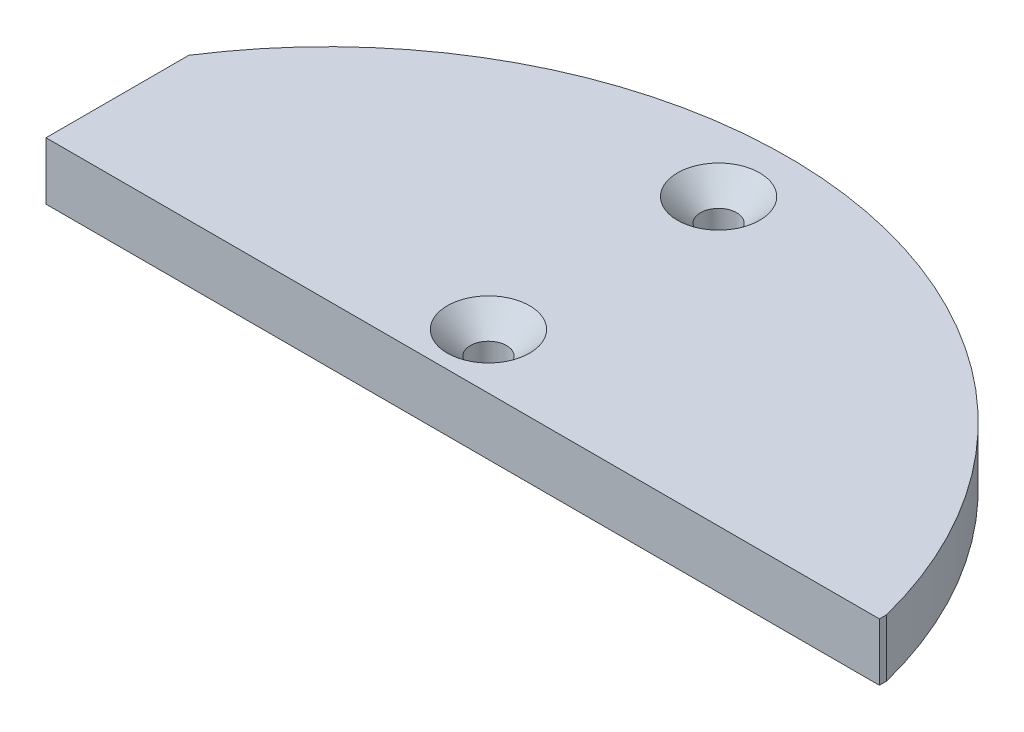
ISO-10303-21;
HEADER;
FILE_DESCRIPTION(('STEP AP214'),'2;1');
FILE_NAME('part.step','',(''),(''),'','','');
FILE_SCHEMA(('AUTOMOTIVE_DESIGN { 1 0 10303 214 1 1 1 1 }'));
ENDSEC;
DATA;
#1=APPLICATION_CONTEXT('core data for automotive mechanical design processes');
#2=APPLICATION_PROTOCOL_DEFINITION('international standard','automotive_design',2000,#1);
#3=PRODUCT_CONTEXT('',#1,'mechanical');
#4=PRODUCT('Part','Part','',(#3));
#5=PRODUCT_RELATED_PRODUCT_CATEGORY('part','',(#4));
#6=PRODUCT_DEFINITION_FORMATION('','',#4);
#7=PRODUCT_DEFINITION_CONTEXT('part definition',#1,'design');
#8=PRODUCT_DEFINITION('design','',#6,#7);
#9=PRODUCT_DEFINITION_SHAPE('','',#8);
#10=(LENGTH_UNIT() NAMED_UNIT(*) SI_UNIT(.MILLI.,.METRE.));
#11=(NAMED_UNIT(*) PLANE_ANGLE_UNIT() SI_UNIT($,.RADIAN.));
#12=(NAMED_UNIT(*) SI_UNIT($,.STERADIAN.) SOLID_ANGLE_UNIT());
#13=UNCERTAINTY_MEASURE_WITH_UNIT(LENGTH_MEASURE(1.E-05),#10,'distance_accuracy_value','');
#14=(GEOMETRIC_REPRESENTATION_CONTEXT(3) GLOBAL_UNCERTAINTY_ASSIGNED_CONTEXT((#13)) GLOBAL_UNIT_ASSIGNED_CONTEXT((#10,
#11,#12)) REPRESENTATION_CONTEXT('',''));
#15=CARTESIAN_POINT('',(0.,0.,0.));
#16=DIRECTION('',(0.,0.,1.));
#17=DIRECTION('',(1.,0.,0.));
#18=AXIS2_PLACEMENT_3D('',#15,#16,#17);
#19=CARTESIAN_POINT('',(0.,6.35,-11.684));
#20=DIRECTION('',(0.,0.,-1.));
#21=DIRECTION('',(-1.,0.,0.));
#22=AXIS2_PLACEMENT_3D('',#19,#20,#21);
#23=PLANE('',#22);
#24=DIRECTION('',(1.,0.,0.));
#25=VECTOR('',#24,1.);
#26=CARTESIAN_POINT('',(0.,0.,-11.684));
#27=LINE('',#26,#25);
#28=CARTESIAN_POINT('',(-42.746,0.,-11.684));
#29=VERTEX_POINT('',#28);
#30=CARTESIAN_POINT('',(49.2434251855589,0.,-11.684));
#31=VERTEX_POINT('',#30);
#32=EDGE_CURVE('E406',#29,#31,#27,.T.);
#33=ORIENTED_EDGE('',*,*,#32,.T.);
#34=DIRECTION('',(0.,-1.,0.));
#35=VECTOR('',#34,1.);
#36=CARTESIAN_POINT('',(49.2434251855589,6.35,-11.684));
#37=LINE('',#36,#35);
#38=CARTESIAN_POINT('',(49.2434251855589,6.35,-11.684));
#39=VERTEX_POINT('',#38);
#40=EDGE_CURVE('E386',#39,#31,#37,.T.);
#41=ORIENTED_EDGE('',*,*,#40,.F.);
#42=DIRECTION('',(1.,0.,0.));
#43=VECTOR('',#42,1.);
#44=CARTESIAN_POINT('',(0.,6.35,-11.684));
#45=LINE('',#44,#43);
#46=CARTESIAN_POINT('',(-42.746,6.35,-11.684));
#47=VERTEX_POINT('',#46);
#48=EDGE_CURVE('E400',#47,#39,#45,.T.);
#49=ORIENTED_EDGE('',*,*,#48,.F.);
#50=DIRECTION('',(0.,-1.,0.));
#51=VECTOR('',#50,1.);
#52=CARTESIAN_POINT('',(-42.746,6.35,-11.684));
#53=LINE('',#52,#51);
#54=EDGE_CURVE('E394',#47,#29,#53,.T.);
#55=ORIENTED_EDGE('',*,*,#54,.T.);
#56=EDGE_LOOP('',(#33,#41,#49,#55));
#57=FACE_BOUND('',#56,.T.);
#58=ADVANCED_FACE('F49',(#57),#23,.F.);
#59=CARTESIAN_POINT('',(49.2434251855589,6.35,0.));
#60=DIRECTION('',(-1.,0.,0.));
#61=DIRECTION('',(0.,0.,1.));
#62=AXIS2_PLACEMENT_3D('',#59,#60,#61);
#63=PLANE('',#62);
#64=DIRECTION('',(0.,0.,-1.));
#65=VECTOR('',#64,1.);
#66=CARTESIAN_POINT('',(49.2434251855589,0.,0.));
#67=LINE('',#66,#65);
#68=CARTESIAN_POINT('',(49.2434251855589,0.,-12.4789853751923));
#69=VERTEX_POINT('',#68);
#70=EDGE_CURVE('E404',#31,#69,#67,.T.);
#71=ORIENTED_EDGE('',*,*,#70,.T.);
#72=DIRECTION('',(0.,-1.,0.));
#73=VECTOR('',#72,1.);
#74=CARTESIAN_POINT('',(49.2434251855589,6.35,-12.4789853751923));
#75=LINE('',#74,#73);
#76=CARTESIAN_POINT('',(49.2434251855589,6.35,-12.4789853751923));
#77=VERTEX_POINT('',#76);
#78=EDGE_CURVE('E389',#77,#69,#75,.T.);
#79=ORIENTED_EDGE('',*,*,#78,.F.);
#80=DIRECTION('',(0.,0.,-1.));
#81=VECTOR('',#80,1.);
#82=CARTESIAN_POINT('',(49.2434251855589,6.35,0.));
#83=LINE('',#82,#81);
#84=EDGE_CURVE('E419',#39,#77,#83,.T.);
#85=ORIENTED_EDGE('',*,*,#84,.F.);
#86=ORIENTED_EDGE('',*,*,#40,.T.);
#87=EDGE_LOOP('',(#71,#79,#85,#86));
#88=FACE_BOUND('',#87,.T.);
#89=ADVANCED_FACE('F526',(#88),#63,.F.);
#90=CARTESIAN_POINT('',(0.,6.35,0.));
#91=DIRECTION('',(0.,-1.,0.));
#92=DIRECTION('',(0.,0.,-1.));
#93=AXIS2_PLACEMENT_3D('',#90,#91,#92);
#94=CYLINDRICAL_SURFACE('',#93,50.8);
#95=CARTESIAN_POINT('',(0.,0.,0.));
#96=DIRECTION('',(0.,1.,0.));
#97=DIRECTION('',(0.,0.,1.));
#98=AXIS2_PLACEMENT_3D('',#95,#96,#97);
#99=CIRCLE('',#98,50.8);
#100=CARTESIAN_POINT('',(-42.746,0.,-27.448487827201));
#101=VERTEX_POINT('',#100);
#102=EDGE_CURVE('E401',#69,#101,#99,.T.);
#103=ORIENTED_EDGE('',*,*,#102,.T.);
#104=DIRECTION('',(0.,-1.,0.));
#105=VECTOR('',#104,1.);
#106=CARTESIAN_POINT('',(-42.746,6.35,-27.448487827201));
#107=LINE('',#106,#105);
#108=CARTESIAN_POINT('',(-42.746,6.35,-27.448487827201));
#109=VERTEX_POINT('',#108);
#110=EDGE_CURVE('E392',#109,#101,#107,.T.);
#111=ORIENTED_EDGE('',*,*,#110,.F.);
#112=CARTESIAN_POINT('',(0.,6.35,0.));
#113=DIRECTION('',(0.,1.,0.));
#114=DIRECTION('',(0.,0.,1.));
#115=AXIS2_PLACEMENT_3D('',#112,#113,#114);
#116=CIRCLE('',#115,50.8);
#117=EDGE_CURVE('E417',#77,#109,#116,.T.);
#118=ORIENTED_EDGE('',*,*,#117,.F.);
#119=ORIENTED_EDGE('',*,*,#78,.T.);
#120=EDGE_LOOP('',(#103,#111,#118,#119));
#121=FACE_BOUND('',#120,.T.);
#122=ADVANCED_FACE('F532',(#121),#94,.T.);
#123=CARTESIAN_POINT('',(0.,6.35,-17.78));
#124=DIRECTION('',(0.,-1.,0.));
#125=DIRECTION('',(0.,0.,-1.));
#126=AXIS2_PLACEMENT_3D('',#123,#124,#125);
#127=CYLINDRICAL_SURFACE('',#126,2.);
#128=CARTESIAN_POINT('',(0.,3.80999999999996,-17.78));
#129=DIRECTION('',(0.,1.,0.));
#130=DIRECTION('',(0.,0.,1.));
#131=AXIS2_PLACEMENT_3D('',#128,#129,#130);
#132=CIRCLE('',#131,2.);
#133=CARTESIAN_POINT('',(0.,3.80999999999996,-15.78));
#134=VERTEX_POINT('',#133);
#135=EDGE_CURVE('E383',#134,#134,#132,.T.);
#136=ORIENTED_EDGE('',*,*,#135,.T.);
#137=EDGE_LOOP('',(#136));
#138=FACE_BOUND('',#137,.T.);
#139=CARTESIAN_POINT('',(0.,0.,-17.78));
#140=DIRECTION('',(0.,1.,0.));
#141=DIRECTION('',(0.,0.,1.));
#142=AXIS2_PLACEMENT_3D('',#139,#140,#141);
#143=CIRCLE('',#142,2.);
#144=CARTESIAN_POINT('',(0.,0.,-15.78));
#145=VERTEX_POINT('',#144);
#146=EDGE_CURVE('E409',#145,#145,#143,.T.);
#147=ORIENTED_EDGE('',*,*,#146,.F.);
#148=EDGE_LOOP('',(#147));
#149=FACE_BOUND('',#148,.T.);
#150=ADVANCED_FACE('F537',(#138,#149),#127,.F.);
#151=CARTESIAN_POINT('',(0.,6.35,-43.18));
#152=DIRECTION('',(0.,-1.,0.));
#153=DIRECTION('',(0.,0.,-1.));
#154=AXIS2_PLACEMENT_3D('',#151,#152,#153);
#155=CYLINDRICAL_SURFACE('',#154,2.);
#156=CARTESIAN_POINT('',(0.,3.81000000000001,-43.18));
#157=DIRECTION('',(0.,1.,0.));
#158=DIRECTION('',(0.,0.,1.));
#159=AXIS2_PLACEMENT_3D('',#156,#157,#158);
#160=CIRCLE('',#159,2.);
#161=CARTESIAN_POINT('',(0.,3.81000000000001,-41.18));
#162=VERTEX_POINT('',#161);
#163=EDGE_CURVE('E374',#162,#162,#160,.T.);
#164=ORIENTED_EDGE('',*,*,#163,.T.);
#165=EDGE_LOOP('',(#164));
#166=FACE_BOUND('',#165,.T.);
#167=CARTESIAN_POINT('',(0.,0.,-43.18));
#168=DIRECTION('',(0.,1.,0.));
#169=DIRECTION('',(0.,0.,1.));
#170=AXIS2_PLACEMENT_3D('',#167,#168,#169);
#171=CIRCLE('',#170,2.);
#172=CARTESIAN_POINT('',(0.,0.,-41.18));
#173=VERTEX_POINT('',#172);
#174=EDGE_CURVE('E412',#173,#173,#171,.T.);
#175=ORIENTED_EDGE('',*,*,#174,.F.);
#176=EDGE_LOOP('',(#175));
#177=FACE_BOUND('',#176,.T.);
#178=ADVANCED_FACE('F540',(#166,#177),#155,.F.);
#179=CARTESIAN_POINT('',(-42.746,6.35,0.));
#180=DIRECTION('',(-1.,0.,0.));
#181=DIRECTION('',(0.,0.,1.));
#182=AXIS2_PLACEMENT_3D('',#179,#180,#181);
#183=PLANE('',#182);
#184=DIRECTION('',(0.,0.,-1.));
#185=VECTOR('',#184,1.);
#186=CARTESIAN_POINT('',(-42.746,0.,0.));
#187=LINE('',#186,#185);
#188=EDGE_CURVE('E397',#29,#101,#187,.T.);
#189=ORIENTED_EDGE('',*,*,#188,.F.);
#190=ORIENTED_EDGE('',*,*,#54,.F.);
#191=DIRECTION('',(0.,0.,-1.));
#192=VECTOR('',#191,1.);
#193=CARTESIAN_POINT('',(-42.746,6.35,0.));
#194=LINE('',#193,#192);
#195=EDGE_CURVE('E396',#47,#109,#194,.T.);
#196=ORIENTED_EDGE('',*,*,#195,.T.);
#197=ORIENTED_EDGE('',*,*,#110,.T.);
#198=EDGE_LOOP('',(#189,#190,#196,#197));
#199=FACE_BOUND('',#198,.T.);
#200=ADVANCED_FACE('F544',(#199),#183,.T.);
#201=CARTESIAN_POINT('',(0.,6.35,0.));
#202=DIRECTION('',(0.,1.,0.));
#203=DIRECTION('',(0.,0.,1.));
#204=AXIS2_PLACEMENT_3D('',#201,#202,#203);
#205=PLANE('',#204);
#206=CARTESIAN_POINT('',(0.,6.35,-17.78));
#207=DIRECTION('',(0.,1.,0.));
#208=DIRECTION('',(0.,0.,1.));
#209=AXIS2_PLACEMENT_3D('',#206,#207,#208);
#210=CIRCLE('',#209,4.54000000000003);
#211=CARTESIAN_POINT('',(0.,6.35,-13.24));
#212=VERTEX_POINT('',#211);
#213=EDGE_CURVE('E377',#212,#212,#210,.F.);
#214=ORIENTED_EDGE('',*,*,#213,.T.);
#215=EDGE_LOOP('',(#214));
#216=FACE_BOUND('',#215,.T.);
#217=CARTESIAN_POINT('',(0.,6.35,-43.18));
#218=DIRECTION('',(0.,1.,0.));
#219=DIRECTION('',(0.,0.,1.));
#220=AXIS2_PLACEMENT_3D('',#217,#218,#219);
#221=CIRCLE('',#220,4.54);
#222=CARTESIAN_POINT('',(0.,6.35,-38.64));
#223=VERTEX_POINT('',#222);
#224=EDGE_CURVE('E380',#223,#223,#221,.F.);
#225=ORIENTED_EDGE('',*,*,#224,.T.);
#226=EDGE_LOOP('',(#225));
#227=FACE_BOUND('',#226,.T.);
#228=ORIENTED_EDGE('',*,*,#48,.T.);
#229=ORIENTED_EDGE('',*,*,#84,.T.);
#230=ORIENTED_EDGE('',*,*,#117,.T.);
#231=ORIENTED_EDGE('',*,*,#195,.F.);
#232=EDGE_LOOP('',(#228,#229,#230,#231));
#233=FACE_BOUND('',#232,.T.);
#234=ADVANCED_FACE('F593',(#216,#227,#233),#205,.T.);
#235=CARTESIAN_POINT('',(0.,0.,0.));
#236=DIRECTION('',(0.,1.,0.));
#237=DIRECTION('',(0.,0.,1.));
#238=AXIS2_PLACEMENT_3D('',#235,#236,#237);
#239=PLANE('',#238);
#240=CARTESIAN_POINT('',(0.,0.,-43.18));
#241=DIRECTION('',(0.,-1.,0.));
#242=DIRECTION('',(0.,0.,-1.));
#243=AXIS2_PLACEMENT_3D('',#240,#241,#242);
#244=CIRCLE('',#243,4.);
#245=CARTESIAN_POINT('',(3.09336815449122,0.,-45.7159561235912));
#246=VERTEX_POINT('',#245);
#247=CARTESIAN_POINT('',(-3.09336815449122,0.,-45.7159561235912));
#248=VERTEX_POINT('',#247);
#249=EDGE_CURVE('E427',#246,#248,#244,.T.);
#250=ORIENTED_EDGE('',*,*,#249,.T.);
#251=CARTESIAN_POINT('',(-4.64005223173683,0.,-46.9839341853867));
#252=DIRECTION('',(0.,-1.,0.));
#253=DIRECTION('',(0.,0.,-1.));
#254=AXIS2_PLACEMENT_3D('',#251,#252,#253);
#255=CIRCLE('',#254,2.);
#256=CARTESIAN_POINT('',(-4.83661255926606,0.,-48.9742517574444));
#257=VERTEX_POINT('',#256);
#258=EDGE_CURVE('E258',#257,#248,#255,.T.);
#259=ORIENTED_EDGE('',*,*,#258,.F.);
#260=CARTESIAN_POINT('',(0.,0.,0.));
#261=DIRECTION('',(0.,-1.,0.));
#262=DIRECTION('',(0.,0.,-1.));
#263=AXIS2_PLACEMENT_3D('',#260,#261,#262);
#264=CIRCLE('',#263,49.2125);
#265=CARTESIAN_POINT('',(-40.4459536909041,0.,-28.0356021209327));
#266=VERTEX_POINT('',#265);
#267=EDGE_CURVE('E252',#266,#257,#264,.T.);
#268=ORIENTED_EDGE('',*,*,#267,.F.);
#269=CARTESIAN_POINT('',(-37.1585,0.,-25.7568638230667));
#270=DIRECTION('',(0.,1.,0.));
#271=DIRECTION('',(0.,0.,1.));
#272=AXIS2_PLACEMENT_3D('',#269,#270,#271);
#273=CIRCLE('',#272,4.);
#274=CARTESIAN_POINT('',(-41.1585,0.,-25.7568638230667));
#275=VERTEX_POINT('',#274);
#276=EDGE_CURVE('E358',#266,#275,#273,.T.);
#277=ORIENTED_EDGE('',*,*,#276,.T.);
#278=DIRECTION('',(0.,0.,-1.));
#279=VECTOR('',#278,1.);
#280=CARTESIAN_POINT('',(-41.1585,0.,0.));
#281=LINE('',#280,#279);
#282=CARTESIAN_POINT('',(-41.1585,0.,-17.2715));
#283=VERTEX_POINT('',#282);
#284=EDGE_CURVE('E234',#283,#275,#281,.T.);
#285=ORIENTED_EDGE('',*,*,#284,.F.);
#286=CARTESIAN_POINT('',(-37.1585,0.,-17.2715));
#287=DIRECTION('',(0.,1.,0.));
#288=DIRECTION('',(0.,0.,1.));
#289=AXIS2_PLACEMENT_3D('',#286,#287,#288);
#290=CIRCLE('',#289,4.);
#291=CARTESIAN_POINT('',(-37.1585,0.,-13.2715));
#292=VERTEX_POINT('',#291);
#293=EDGE_CURVE('E233',#283,#292,#290,.T.);
#294=ORIENTED_EDGE('',*,*,#293,.T.);
#295=DIRECTION('',(-1.,0.,0.));
#296=VECTOR('',#295,1.);
#297=CARTESIAN_POINT('',(0.,0.,-13.2715));
#298=LINE('',#297,#296);
#299=CARTESIAN_POINT('',(-5.45045206840681,0.,-13.2715));
#300=VERTEX_POINT('',#299);
#301=EDGE_CURVE('E210',#300,#292,#298,.T.);
#302=ORIENTED_EDGE('',*,*,#301,.F.);
#303=CARTESIAN_POINT('',(-5.45045206840681,0.,-15.2715));
#304=DIRECTION('',(0.,-1.,0.));
#305=DIRECTION('',(0.,0.,-1.));
#306=AXIS2_PLACEMENT_3D('',#303,#304,#305);
#307=CIRCLE('',#306,2.);
#308=CARTESIAN_POINT('',(-3.63363471227121,0.,-16.1076666666667));
#309=VERTEX_POINT('',#308);
#310=EDGE_CURVE('E219',#309,#300,#307,.T.);
#311=ORIENTED_EDGE('',*,*,#310,.F.);
#312=CARTESIAN_POINT('',(0.,0.,-17.78));
#313=DIRECTION('',(0.,-1.,0.));
#314=DIRECTION('',(0.,0.,-1.));
#315=AXIS2_PLACEMENT_3D('',#312,#313,#314);
#316=CIRCLE('',#315,4.);
#317=CARTESIAN_POINT('',(3.63363471227121,0.,-16.1076666666667));
#318=VERTEX_POINT('',#317);
#319=EDGE_CURVE('E216',#309,#318,#316,.T.);
#320=ORIENTED_EDGE('',*,*,#319,.T.);
#321=CARTESIAN_POINT('',(5.45045206840681,0.,-15.2715));
#322=DIRECTION('',(0.,-1.,0.));
#323=DIRECTION('',(0.,0.,-1.));
#324=AXIS2_PLACEMENT_3D('',#321,#322,#323);
#325=CIRCLE('',#324,2.);
#326=CARTESIAN_POINT('',(5.45045206840681,0.,-13.2715));
#327=VERTEX_POINT('',#326);
#328=EDGE_CURVE('E226',#327,#318,#325,.T.);
#329=ORIENTED_EDGE('',*,*,#328,.F.);
#330=CARTESIAN_POINT('',(41.7835547075641,0.,-13.2715));
#331=VERTEX_POINT('',#330);
#332=EDGE_CURVE('E236',#331,#327,#298,.T.);
#333=ORIENTED_EDGE('',*,*,#332,.F.);
#334=CARTESIAN_POINT('',(41.7835547075641,0.,-17.2715));
#335=DIRECTION('',(0.,1.,0.));
#336=DIRECTION('',(0.,0.,1.));
#337=AXIS2_PLACEMENT_3D('',#334,#335,#336);
#338=CIRCLE('',#337,4.);
#339=CARTESIAN_POINT('',(45.4801921160298,0.,-18.7995287531103));
#340=VERTEX_POINT('',#339);
#341=EDGE_CURVE('E360',#331,#340,#338,.T.);
#342=ORIENTED_EDGE('',*,*,#341,.T.);
#343=CARTESIAN_POINT('',(4.83661255926606,0.,-48.9742517574444));
#344=VERTEX_POINT('',#343);
#345=EDGE_CURVE('E243',#344,#340,#264,.T.);
#346=ORIENTED_EDGE('',*,*,#345,.F.);
#347=CARTESIAN_POINT('',(4.64005223173683,0.,-46.9839341853867));
#348=DIRECTION('',(0.,-1.,0.));
#349=DIRECTION('',(0.,0.,-1.));
#350=AXIS2_PLACEMENT_3D('',#347,#348,#349);
#351=CIRCLE('',#350,2.);
#352=EDGE_CURVE('E250',#246,#344,#351,.T.);
#353=ORIENTED_EDGE('',*,*,#352,.F.);
#354=EDGE_LOOP('',(#250,#259,#268,#277,#285,#294,#302,#311,#320,#329,#333,#342,#346,#353));
#355=FACE_BOUND('',#354,.T.);
#356=ORIENTED_EDGE('',*,*,#174,.T.);
#357=EDGE_LOOP('',(#356));
#358=FACE_BOUND('',#357,.T.);
#359=ORIENTED_EDGE('',*,*,#146,.T.);
#360=EDGE_LOOP('',(#359));
#361=FACE_BOUND('',#360,.T.);
#362=ORIENTED_EDGE('',*,*,#32,.F.);
#363=ORIENTED_EDGE('',*,*,#188,.T.);
#364=ORIENTED_EDGE('',*,*,#102,.F.);
#365=ORIENTED_EDGE('',*,*,#70,.F.);
#366=EDGE_LOOP('',(#362,#363,#364,#365));
#367=FACE_BOUND('',#366,.T.);
#368=ADVANCED_FACE('F229',(#355,#358,#361,#367),#239,.F.);
#369=CARTESIAN_POINT('',(0.,3.80999999999996,-17.78));
#370=DIRECTION('',(0.,1.,0.));
#371=DIRECTION('',(0.,0.,1.));
#372=AXIS2_PLACEMENT_3D('',#369,#370,#371);
#373=CONICAL_SURFACE('',#372,2.,0.785398163397447);
#374=ORIENTED_EDGE('',*,*,#213,.F.);
#375=EDGE_LOOP('',(#374));
#376=FACE_BOUND('',#375,.T.);
#377=ORIENTED_EDGE('',*,*,#135,.F.);
#378=EDGE_LOOP('',(#377));
#379=FACE_BOUND('',#378,.T.);
#380=ADVANCED_FACE('F547',(#376,#379),#373,.F.);
#381=CARTESIAN_POINT('',(0.,3.81000000000001,-43.18));
#382=DIRECTION('',(0.,1.,0.));
#383=DIRECTION('',(0.,0.,1.));
#384=AXIS2_PLACEMENT_3D('',#381,#382,#383);
#385=CONICAL_SURFACE('',#384,2.,0.78539816339745);
#386=ORIENTED_EDGE('',*,*,#224,.F.);
#387=EDGE_LOOP('',(#386));
#388=FACE_BOUND('',#387,.T.);
#389=ORIENTED_EDGE('',*,*,#163,.F.);
#390=EDGE_LOOP('',(#389));
#391=FACE_BOUND('',#390,.T.);
#392=ADVANCED_FACE('F553',(#388,#391),#385,.F.);
#393=CARTESIAN_POINT('',(0.,4.7625,0.));
#394=DIRECTION('',(0.,1.,0.));
#395=DIRECTION('',(0.,0.,1.));
#396=AXIS2_PLACEMENT_3D('',#393,#394,#395);
#397=PLANE('',#396);
#398=DIRECTION('',(-1.,0.,0.));
#399=VECTOR('',#398,1.);
#400=CARTESIAN_POINT('',(5.45045206840681,4.7625,-15.2715));
#401=LINE('',#400,#399);
#402=CARTESIAN_POINT('',(41.7835547075641,4.7625,-15.2715));
#403=VERTEX_POINT('',#402);
#404=CARTESIAN_POINT('',(5.45045206840681,4.7625,-15.2715));
#405=VERTEX_POINT('',#404);
#406=EDGE_CURVE('E335',#403,#405,#401,.T.);
#407=ORIENTED_EDGE('',*,*,#406,.T.);
#408=CARTESIAN_POINT('',(0.,4.7625,-17.78));
#409=DIRECTION('',(0.,1.,0.));
#410=DIRECTION('',(0.,0.,1.));
#411=AXIS2_PLACEMENT_3D('',#408,#409,#410);
#412=CIRCLE('',#411,6.);
#413=CARTESIAN_POINT('',(-5.45045206840681,4.7625,-15.2715));
#414=VERTEX_POINT('',#413);
#415=EDGE_CURVE('E332',#405,#414,#412,.T.);
#416=ORIENTED_EDGE('',*,*,#415,.T.);
#417=DIRECTION('',(-1.,0.,0.));
#418=VECTOR('',#417,1.);
#419=CARTESIAN_POINT('',(-37.1585,4.7625,-15.2715));
#420=LINE('',#419,#418);
#421=CARTESIAN_POINT('',(-37.1585,4.7625,-15.2715));
#422=VERTEX_POINT('',#421);
#423=EDGE_CURVE('E351',#414,#422,#420,.T.);
#424=ORIENTED_EDGE('',*,*,#423,.T.);
#425=CARTESIAN_POINT('',(-37.1585,4.7625,-17.2715));
#426=DIRECTION('',(0.,1.,0.));
#427=DIRECTION('',(0.,0.,1.));
#428=AXIS2_PLACEMENT_3D('',#425,#426,#427);
#429=CIRCLE('',#428,2.);
#430=CARTESIAN_POINT('',(-39.1585,4.7625,-17.2715));
#431=VERTEX_POINT('',#430);
#432=EDGE_CURVE('E349',#422,#431,#429,.F.);
#433=ORIENTED_EDGE('',*,*,#432,.T.);
#434=DIRECTION('',(0.,0.,-1.));
#435=VECTOR('',#434,1.);
#436=CARTESIAN_POINT('',(-39.1585,4.7625,-25.7568638230667));
#437=LINE('',#436,#435);
#438=CARTESIAN_POINT('',(-39.1585,4.7625,-25.7568638230667));
#439=VERTEX_POINT('',#438);
#440=EDGE_CURVE('E347',#431,#439,#437,.T.);
#441=ORIENTED_EDGE('',*,*,#440,.T.);
#442=CARTESIAN_POINT('',(-37.1585,4.7625,-25.7568638230667));
#443=DIRECTION('',(0.,1.,0.));
#444=DIRECTION('',(0.,0.,1.));
#445=AXIS2_PLACEMENT_3D('',#442,#443,#444);
#446=CIRCLE('',#445,2.);
#447=CARTESIAN_POINT('',(-38.802226845452,4.7625,-26.8962329719997));
#448=VERTEX_POINT('',#447);
#449=EDGE_CURVE('E345',#439,#448,#446,.F.);
#450=ORIENTED_EDGE('',*,*,#449,.T.);
#451=CARTESIAN_POINT('',(0.,4.7625,0.));
#452=DIRECTION('',(0.,1.,0.));
#453=DIRECTION('',(0.,0.,1.));
#454=AXIS2_PLACEMENT_3D('',#451,#452,#453);
#455=CIRCLE('',#454,47.2125);
#456=CARTESIAN_POINT('',(-4.64005223173683,4.7625,-46.9839341853867));
#457=VERTEX_POINT('',#456);
#458=EDGE_CURVE('E343',#448,#457,#455,.F.);
#459=ORIENTED_EDGE('',*,*,#458,.T.);
#460=CARTESIAN_POINT('',(0.,4.7625,-43.18));
#461=DIRECTION('',(0.,1.,0.));
#462=DIRECTION('',(0.,0.,1.));
#463=AXIS2_PLACEMENT_3D('',#460,#461,#462);
#464=CIRCLE('',#463,6.);
#465=CARTESIAN_POINT('',(4.64005223173684,4.7625,-46.9839341853868));
#466=VERTEX_POINT('',#465);
#467=EDGE_CURVE('E341',#457,#466,#464,.T.);
#468=ORIENTED_EDGE('',*,*,#467,.T.);
#469=CARTESIAN_POINT('',(0.,4.7625,0.));
#470=DIRECTION('',(0.,1.,0.));
#471=DIRECTION('',(0.,0.,1.));
#472=AXIS2_PLACEMENT_3D('',#469,#470,#471);
#473=CIRCLE('',#472,47.2125);
#474=CARTESIAN_POINT('',(43.6318734117969,4.7625,-18.0355143765551));
#475=VERTEX_POINT('',#474);
#476=EDGE_CURVE('E339',#466,#475,#473,.F.);
#477=ORIENTED_EDGE('',*,*,#476,.T.);
#478=CARTESIAN_POINT('',(41.7835547075641,4.7625,-17.2715));
#479=DIRECTION('',(0.,1.,0.));
#480=DIRECTION('',(0.,0.,1.));
#481=AXIS2_PLACEMENT_3D('',#478,#479,#480);
#482=CIRCLE('',#481,2.);
#483=EDGE_CURVE('E337',#475,#403,#482,.F.);
#484=ORIENTED_EDGE('',*,*,#483,.T.);
#485=EDGE_LOOP('',(#407,#416,#424,#433,#441,#450,#459,#468,#477,#484));
#486=FACE_BOUND('',#485,.T.);
#487=ADVANCED_FACE('F459',(#486),#397,.F.);
#488=CARTESIAN_POINT('',(-4.64005223173683,101.828140492847,-46.9839341853867));
#489=DIRECTION('',(0.,-1.,0.));
#490=DIRECTION('',(0.,0.,-1.));
#491=AXIS2_PLACEMENT_3D('',#488,#489,#490);
#492=CYLINDRICAL_SURFACE('',#491,2.);
#493=DIRECTION('',(0.,-1.,0.));
#494=VECTOR('',#493,1.);
#495=CARTESIAN_POINT('',(-3.09336815449122,101.828140492847,-45.7159561235912));
#496=LINE('',#495,#494);
#497=CARTESIAN_POINT('',(-3.09336815449122,2.76250000000003,-45.7159561235912));
#498=VERTEX_POINT('',#497);
#499=EDGE_CURVE('E238',#498,#248,#496,.T.);
#500=ORIENTED_EDGE('',*,*,#499,.F.);
#501=CARTESIAN_POINT('',(-4.64005223173683,2.7625,-46.9839341853867));
#502=DIRECTION('',(0.,-1.,0.));
#503=DIRECTION('',(0.,0.,-1.));
#504=AXIS2_PLACEMENT_3D('',#501,#502,#503);
#505=CIRCLE('',#504,2.);
#506=CARTESIAN_POINT('',(-4.83661255926606,2.76250000000003,-48.9742517574444));
#507=VERTEX_POINT('',#506);
#508=EDGE_CURVE('E318',#498,#507,#505,.F.);
#509=ORIENTED_EDGE('',*,*,#508,.T.);
#510=DIRECTION('',(0.,-1.,0.));
#511=VECTOR('',#510,1.);
#512=CARTESIAN_POINT('',(-4.83661255926606,101.828140492847,-48.9742517574444));
#513=LINE('',#512,#511);
#514=EDGE_CURVE('E215',#507,#257,#513,.T.);
#515=ORIENTED_EDGE('',*,*,#514,.T.);
#516=ORIENTED_EDGE('',*,*,#258,.T.);
#517=EDGE_LOOP('',(#500,#509,#515,#516));
#518=FACE_BOUND('',#517,.T.);
#519=ADVANCED_FACE('F490',(#518),#492,.F.);
#520=CARTESIAN_POINT('',(0.,101.828140492847,-43.18));
#521=DIRECTION('',(0.,-1.,0.));
#522=DIRECTION('',(0.,0.,-1.));
#523=AXIS2_PLACEMENT_3D('',#520,#521,#522);
#524=CYLINDRICAL_SURFACE('',#523,4.);
#525=DIRECTION('',(0.,-1.,0.));
#526=VECTOR('',#525,1.);
#527=CARTESIAN_POINT('',(3.09336815449122,101.828140492847,-45.7159561235912));
#528=LINE('',#527,#526);
#529=CARTESIAN_POINT('',(3.09336815449122,2.76250000000004,-45.7159561235912));
#530=VERTEX_POINT('',#529);
#531=EDGE_CURVE('E425',#530,#246,#528,.T.);
#532=ORIENTED_EDGE('',*,*,#531,.F.);
#533=CARTESIAN_POINT('',(0.,2.76250000000001,-43.18));
#534=DIRECTION('',(0.,1.,0.));
#535=DIRECTION('',(0.,0.,1.));
#536=AXIS2_PLACEMENT_3D('',#533,#534,#535);
#537=CIRCLE('',#536,4.);
#538=EDGE_CURVE('E320',#530,#498,#537,.F.);
#539=ORIENTED_EDGE('',*,*,#538,.T.);
#540=ORIENTED_EDGE('',*,*,#499,.T.);
#541=ORIENTED_EDGE('',*,*,#249,.F.);
#542=EDGE_LOOP('',(#532,#539,#540,#541));
#543=FACE_BOUND('',#542,.T.);
#544=ADVANCED_FACE('F482',(#543),#524,.T.);
#545=CARTESIAN_POINT('',(4.64005223173683,101.828140492847,-46.9839341853867));
#546=DIRECTION('',(0.,-1.,0.));
#547=DIRECTION('',(0.,0.,-1.));
#548=AXIS2_PLACEMENT_3D('',#545,#546,#547);
#549=CYLINDRICAL_SURFACE('',#548,2.);
#550=DIRECTION('',(0.,-1.,0.));
#551=VECTOR('',#550,1.);
#552=CARTESIAN_POINT('',(4.83661255926606,101.828140492847,-48.9742517574444));
#553=LINE('',#552,#551);
#554=CARTESIAN_POINT('',(4.83661255926606,2.76250000000003,-48.9742517574444));
#555=VERTEX_POINT('',#554);
#556=EDGE_CURVE('E428',#555,#344,#553,.T.);
#557=ORIENTED_EDGE('',*,*,#556,.F.);
#558=CARTESIAN_POINT('',(4.64005223173683,2.7625,-46.9839341853867));
#559=DIRECTION('',(0.,-1.,0.));
#560=DIRECTION('',(0.,0.,-1.));
#561=AXIS2_PLACEMENT_3D('',#558,#559,#560);
#562=CIRCLE('',#561,2.);
#563=EDGE_CURVE('E322',#555,#530,#562,.F.);
#564=ORIENTED_EDGE('',*,*,#563,.T.);
#565=ORIENTED_EDGE('',*,*,#531,.T.);
#566=ORIENTED_EDGE('',*,*,#352,.T.);
#567=EDGE_LOOP('',(#557,#564,#565,#566));
#568=FACE_BOUND('',#567,.T.);
#569=ADVANCED_FACE('F478',(#568),#549,.F.);
#570=CARTESIAN_POINT('',(0.,101.828140492847,0.));
#571=DIRECTION('',(0.,-1.,0.));
#572=DIRECTION('',(0.,0.,-1.));
#573=AXIS2_PLACEMENT_3D('',#570,#571,#572);
#574=CYLINDRICAL_SURFACE('',#573,49.2125);
#575=DIRECTION('',(0.,-1.,0.));
#576=VECTOR('',#575,1.);
#577=CARTESIAN_POINT('',(45.4801921160298,101.828140492847,-18.7995287531103));
#578=LINE('',#577,#576);
#579=CARTESIAN_POINT('',(45.4801921160298,2.76250000000003,-18.7995287531103));
#580=VERTEX_POINT('',#579);
#581=EDGE_CURVE('E370',#340,#580,#578,.F.);
#582=ORIENTED_EDGE('',*,*,#581,.T.);
#583=CARTESIAN_POINT('',(0.,2.7625,0.));
#584=DIRECTION('',(0.,1.,0.));
#585=DIRECTION('',(0.,0.,1.));
#586=AXIS2_PLACEMENT_3D('',#583,#584,#585);
#587=CIRCLE('',#586,49.2125);
#588=EDGE_CURVE('E324',#580,#555,#587,.T.);
#589=ORIENTED_EDGE('',*,*,#588,.T.);
#590=ORIENTED_EDGE('',*,*,#556,.T.);
#591=ORIENTED_EDGE('',*,*,#345,.T.);
#592=EDGE_LOOP('',(#582,#589,#590,#591));
#593=FACE_BOUND('',#592,.T.);
#594=ADVANCED_FACE('F471',(#593),#574,.F.);
#595=CARTESIAN_POINT('',(0.,101.828140492847,-13.2715));
#596=DIRECTION('',(0.,0.,1.));
#597=DIRECTION('',(1.,0.,0.));
#598=AXIS2_PLACEMENT_3D('',#595,#596,#597);
#599=PLANE('',#598);
#600=DIRECTION('',(0.,-1.,0.));
#601=VECTOR('',#600,1.);
#602=CARTESIAN_POINT('',(5.45045206840681,101.828140492847,-13.2715));
#603=LINE('',#602,#601);
#604=CARTESIAN_POINT('',(5.45045206840681,2.76250000000003,-13.2715));
#605=VERTEX_POINT('',#604);
#606=EDGE_CURVE('E430',#605,#327,#603,.T.);
#607=ORIENTED_EDGE('',*,*,#606,.F.);
#608=DIRECTION('',(-1.,0.,0.));
#609=VECTOR('',#608,1.);
#610=CARTESIAN_POINT('',(41.7835547075641,2.7625,-13.2715));
#611=LINE('',#610,#609);
#612=CARTESIAN_POINT('',(41.7835547075641,2.76249999999997,-13.2715));
#613=VERTEX_POINT('',#612);
#614=EDGE_CURVE('E328',#605,#613,#611,.F.);
#615=ORIENTED_EDGE('',*,*,#614,.T.);
#616=DIRECTION('',(0.,1.,0.));
#617=VECTOR('',#616,1.);
#618=CARTESIAN_POINT('',(41.7835547075641,0.,-13.2715));
#619=LINE('',#618,#617);
#620=EDGE_CURVE('E372',#613,#331,#619,.F.);
#621=ORIENTED_EDGE('',*,*,#620,.T.);
#622=ORIENTED_EDGE('',*,*,#332,.T.);
#623=EDGE_LOOP('',(#607,#615,#621,#622));
#624=FACE_BOUND('',#623,.T.);
#625=ADVANCED_FACE('F443',(#624),#599,.F.);
#626=CARTESIAN_POINT('',(5.45045206840681,101.828140492847,-15.2715));
#627=DIRECTION('',(0.,-1.,0.));
#628=DIRECTION('',(0.,0.,-1.));
#629=AXIS2_PLACEMENT_3D('',#626,#627,#628);
#630=CYLINDRICAL_SURFACE('',#629,2.);
#631=DIRECTION('',(0.,-1.,0.));
#632=VECTOR('',#631,1.);
#633=CARTESIAN_POINT('',(3.63363471227121,101.828140492847,-16.1076666666667));
#634=LINE('',#633,#632);
#635=CARTESIAN_POINT('',(3.63363471227121,2.76250000000003,-16.1076666666667));
#636=VERTEX_POINT('',#635);
#637=EDGE_CURVE('E432',#636,#318,#634,.T.);
#638=ORIENTED_EDGE('',*,*,#637,.F.);
#639=CARTESIAN_POINT('',(5.45045206840681,2.7625,-15.2715));
#640=DIRECTION('',(0.,-1.,0.));
#641=DIRECTION('',(0.,0.,-1.));
#642=AXIS2_PLACEMENT_3D('',#639,#640,#641);
#643=CIRCLE('',#642,2.);
#644=EDGE_CURVE('E330',#636,#605,#643,.F.);
#645=ORIENTED_EDGE('',*,*,#644,.T.);
#646=ORIENTED_EDGE('',*,*,#606,.T.);
#647=ORIENTED_EDGE('',*,*,#328,.T.);
#648=EDGE_LOOP('',(#638,#645,#646,#647));
#649=FACE_BOUND('',#648,.T.);
#650=ADVANCED_FACE('F441',(#649),#630,.F.);
#651=CARTESIAN_POINT('',(0.,101.828140492847,-17.78));
#652=DIRECTION('',(0.,-1.,0.));
#653=DIRECTION('',(0.,0.,-1.));
#654=AXIS2_PLACEMENT_3D('',#651,#652,#653);
#655=CYLINDRICAL_SURFACE('',#654,4.);
#656=DIRECTION('',(0.,-1.,0.));
#657=VECTOR('',#656,1.);
#658=CARTESIAN_POINT('',(-3.63363471227121,101.828140492847,-16.1076666666667));
#659=LINE('',#658,#657);
#660=CARTESIAN_POINT('',(-3.63363471227121,2.76250000000004,-16.1076666666667));
#661=VERTEX_POINT('',#660);
#662=EDGE_CURVE('E222',#661,#309,#659,.T.);
#663=ORIENTED_EDGE('',*,*,#662,.F.);
#664=CARTESIAN_POINT('',(0.,2.76250000000001,-17.78));
#665=DIRECTION('',(0.,1.,0.));
#666=DIRECTION('',(0.,0.,1.));
#667=AXIS2_PLACEMENT_3D('',#664,#665,#666);
#668=CIRCLE('',#667,4.);
#669=EDGE_CURVE('E353',#661,#636,#668,.F.);
#670=ORIENTED_EDGE('',*,*,#669,.T.);
#671=ORIENTED_EDGE('',*,*,#637,.T.);
#672=ORIENTED_EDGE('',*,*,#319,.F.);
#673=EDGE_LOOP('',(#663,#670,#671,#672));
#674=FACE_BOUND('',#673,.T.);
#675=ADVANCED_FACE('F436',(#674),#655,.T.);
#676=CARTESIAN_POINT('',(-5.45045206840681,101.828140492847,-15.2715));
#677=DIRECTION('',(0.,-1.,0.));
#678=DIRECTION('',(0.,0.,-1.));
#679=AXIS2_PLACEMENT_3D('',#676,#677,#678);
#680=CYLINDRICAL_SURFACE('',#679,2.);
#681=DIRECTION('',(0.,-1.,0.));
#682=VECTOR('',#681,1.);
#683=CARTESIAN_POINT('',(-5.45045206840681,101.828140492847,-13.2715));
#684=LINE('',#683,#682);
#685=CARTESIAN_POINT('',(-5.45045206840681,2.76250000000003,-13.2715));
#686=VERTEX_POINT('',#685);
#687=EDGE_CURVE('E206',#686,#300,#684,.T.);
#688=ORIENTED_EDGE('',*,*,#687,.F.);
#689=CARTESIAN_POINT('',(-5.45045206840681,2.7625,-15.2715));
#690=DIRECTION('',(0.,-1.,0.));
#691=DIRECTION('',(0.,0.,-1.));
#692=AXIS2_PLACEMENT_3D('',#689,#690,#691);
#693=CIRCLE('',#692,2.);
#694=EDGE_CURVE('E355',#686,#661,#693,.F.);
#695=ORIENTED_EDGE('',*,*,#694,.T.);
#696=ORIENTED_EDGE('',*,*,#662,.T.);
#697=ORIENTED_EDGE('',*,*,#310,.T.);
#698=EDGE_LOOP('',(#688,#695,#696,#697));
#699=FACE_BOUND('',#698,.T.);
#700=ADVANCED_FACE('F220',(#699),#680,.F.);
#701=DIRECTION('',(0.,-1.,0.));
#702=VECTOR('',#701,1.);
#703=CARTESIAN_POINT('',(-37.1585,4.7625,-13.2715));
#704=LINE('',#703,#702);
#705=CARTESIAN_POINT('',(-37.1585,2.7625,-13.2715));
#706=VERTEX_POINT('',#705);
#707=EDGE_CURVE('E362',#292,#706,#704,.F.);
#708=ORIENTED_EDGE('',*,*,#707,.T.);
#709=DIRECTION('',(-1.,0.,0.));
#710=VECTOR('',#709,1.);
#711=CARTESIAN_POINT('',(-5.45045206840681,2.7625,-13.2715));
#712=LINE('',#711,#710);
#713=EDGE_CURVE('E12',#706,#686,#712,.F.);
#714=ORIENTED_EDGE('',*,*,#713,.T.);
#715=ORIENTED_EDGE('',*,*,#687,.T.);
#716=ORIENTED_EDGE('',*,*,#301,.T.);
#717=EDGE_LOOP('',(#708,#714,#715,#716));
#718=FACE_BOUND('',#717,.T.);
#719=ADVANCED_FACE('F208',(#718),#599,.F.);
#720=CARTESIAN_POINT('',(-41.1585,101.828140492847,0.));
#721=DIRECTION('',(-1.,0.,0.));
#722=DIRECTION('',(0.,0.,1.));
#723=AXIS2_PLACEMENT_3D('',#720,#721,#722);
#724=PLANE('',#723);
#725=DIRECTION('',(0.,1.,0.));
#726=VECTOR('',#725,1.);
#727=CARTESIAN_POINT('',(-41.1585,4.76250000000003,-25.7568638230667));
#728=LINE('',#727,#726);
#729=CARTESIAN_POINT('',(-41.1585,2.7625,-25.7568638230667));
#730=VERTEX_POINT('',#729);
#731=EDGE_CURVE('E364',#275,#730,#728,.T.);
#732=ORIENTED_EDGE('',*,*,#731,.T.);
#733=DIRECTION('',(0.,0.,-1.));
#734=VECTOR('',#733,1.);
#735=CARTESIAN_POINT('',(-41.1585,2.7625,-17.2715));
#736=LINE('',#735,#734);
#737=CARTESIAN_POINT('',(-41.1585,2.7625,-17.2715));
#738=VERTEX_POINT('',#737);
#739=EDGE_CURVE('E73',#730,#738,#736,.F.);
#740=ORIENTED_EDGE('',*,*,#739,.T.);
#741=DIRECTION('',(0.,-1.,0.));
#742=VECTOR('',#741,1.);
#743=CARTESIAN_POINT('',(-41.1585,0.,-17.2715));
#744=LINE('',#743,#742);
#745=EDGE_CURVE('E366',#738,#283,#744,.T.);
#746=ORIENTED_EDGE('',*,*,#745,.T.);
#747=ORIENTED_EDGE('',*,*,#284,.T.);
#748=EDGE_LOOP('',(#732,#740,#746,#747));
#749=FACE_BOUND('',#748,.T.);
#750=ADVANCED_FACE('F568',(#749),#724,.F.);
#751=ORIENTED_EDGE('',*,*,#514,.F.);
#752=CARTESIAN_POINT('',(0.,2.7625,0.));
#753=DIRECTION('',(0.,1.,0.));
#754=DIRECTION('',(0.,0.,1.));
#755=AXIS2_PLACEMENT_3D('',#752,#753,#754);
#756=CIRCLE('',#755,49.2125);
#757=CARTESIAN_POINT('',(-40.445953690904,2.7625,-28.0356021209327));
#758=VERTEX_POINT('',#757);
#759=EDGE_CURVE('E316',#507,#758,#756,.T.);
#760=ORIENTED_EDGE('',*,*,#759,.T.);
#761=DIRECTION('',(0.,-1.,0.));
#762=VECTOR('',#761,1.);
#763=CARTESIAN_POINT('',(-40.445953690904,101.828140492847,-28.0356021209327));
#764=LINE('',#763,#762);
#765=EDGE_CURVE('E368',#758,#266,#764,.T.);
#766=ORIENTED_EDGE('',*,*,#765,.T.);
#767=ORIENTED_EDGE('',*,*,#267,.T.);
#768=EDGE_LOOP('',(#751,#760,#766,#767));
#769=FACE_BOUND('',#768,.T.);
#770=ADVANCED_FACE('F491',(#769),#574,.F.);
#771=CARTESIAN_POINT('',(41.7835547075641,101.828140492847,-17.2715));
#772=DIRECTION('',(0.,-1.,0.));
#773=DIRECTION('',(0.,0.,-1.));
#774=AXIS2_PLACEMENT_3D('',#771,#772,#773);
#775=CYLINDRICAL_SURFACE('',#774,4.);
#776=ORIENTED_EDGE('',*,*,#620,.F.);
#777=CARTESIAN_POINT('',(41.7835547075641,2.76249999999997,-17.2715));
#778=DIRECTION('',(0.,1.,0.));
#779=DIRECTION('',(0.,0.,1.));
#780=AXIS2_PLACEMENT_3D('',#777,#778,#779);
#781=CIRCLE('',#780,4.);
#782=EDGE_CURVE('E326',#613,#580,#781,.T.);
#783=ORIENTED_EDGE('',*,*,#782,.T.);
#784=ORIENTED_EDGE('',*,*,#581,.F.);
#785=ORIENTED_EDGE('',*,*,#341,.F.);
#786=EDGE_LOOP('',(#776,#783,#784,#785));
#787=FACE_BOUND('',#786,.T.);
#788=ADVANCED_FACE('F468',(#787),#775,.F.);
#789=CARTESIAN_POINT('',(-37.1585,101.828140492847,-25.7568638230667));
#790=DIRECTION('',(0.,-1.,0.));
#791=DIRECTION('',(0.,0.,-1.));
#792=AXIS2_PLACEMENT_3D('',#789,#790,#791);
#793=CYLINDRICAL_SURFACE('',#792,4.);
#794=ORIENTED_EDGE('',*,*,#765,.F.);
#795=CARTESIAN_POINT('',(-37.1585,2.76249999999997,-25.7568638230667));
#796=DIRECTION('',(0.,1.,0.));
#797=DIRECTION('',(0.,0.,1.));
#798=AXIS2_PLACEMENT_3D('',#795,#796,#797);
#799=CIRCLE('',#798,4.);
#800=EDGE_CURVE('E314',#758,#730,#799,.T.);
#801=ORIENTED_EDGE('',*,*,#800,.T.);
#802=ORIENTED_EDGE('',*,*,#731,.F.);
#803=ORIENTED_EDGE('',*,*,#276,.F.);
#804=EDGE_LOOP('',(#794,#801,#802,#803));
#805=FACE_BOUND('',#804,.T.);
#806=ADVANCED_FACE('F497',(#805),#793,.F.);
#807=CARTESIAN_POINT('',(-37.1585,101.828140492847,-17.2715));
#808=DIRECTION('',(0.,1.,0.));
#809=DIRECTION('',(0.,0.,1.));
#810=AXIS2_PLACEMENT_3D('',#807,#808,#809);
#811=CYLINDRICAL_SURFACE('',#810,4.);
#812=ORIENTED_EDGE('',*,*,#745,.F.);
#813=CARTESIAN_POINT('',(-37.1585,2.7625,-17.2715));
#814=DIRECTION('',(0.,1.,0.));
#815=DIRECTION('',(0.,0.,1.));
#816=AXIS2_PLACEMENT_3D('',#813,#814,#815);
#817=CIRCLE('',#816,4.);
#818=EDGE_CURVE('E58',#738,#706,#817,.T.);
#819=ORIENTED_EDGE('',*,*,#818,.T.);
#820=ORIENTED_EDGE('',*,*,#707,.F.);
#821=ORIENTED_EDGE('',*,*,#293,.F.);
#822=EDGE_LOOP('',(#812,#819,#820,#821));
#823=FACE_BOUND('',#822,.T.);
#824=ADVANCED_FACE('F563',(#823),#811,.F.);
#825=CARTESIAN_POINT('',(0.,2.7625,-43.18));
#826=DIRECTION('',(0.,1.,0.));
#827=DIRECTION('',(0.,0.,1.));
#828=AXIS2_PLACEMENT_3D('',#825,#826,#827);
#829=TOROIDAL_SURFACE('',#828,6.,2.);
#830=CARTESIAN_POINT('',(-4.64005223173684,2.7625,-46.9839341853868));
#831=DIRECTION('',(-0.633989030897793,0.,0.773342038622806));
#832=DIRECTION('',(0.773342038622806,0.,0.633989030897792));
#833=AXIS2_PLACEMENT_3D('',#830,#831,#832);
#834=CIRCLE('',#833,2.);
#835=EDGE_CURVE('E267',#498,#457,#834,.T.);
#836=ORIENTED_EDGE('',*,*,#835,.F.);
#837=ORIENTED_EDGE('',*,*,#538,.F.);
#838=CARTESIAN_POINT('',(4.64005223173684,2.7625,-46.9839341853868));
#839=DIRECTION('',(0.633989030897793,0.,0.773342038622806));
#840=DIRECTION('',(0.773342038622806,0.,-0.633989030897793));
#841=AXIS2_PLACEMENT_3D('',#838,#839,#840);
#842=CIRCLE('',#841,2.);
#843=EDGE_CURVE('E53',#466,#530,#842,.T.);
#844=ORIENTED_EDGE('',*,*,#843,.F.);
#845=ORIENTED_EDGE('',*,*,#467,.F.);
#846=EDGE_LOOP('',(#836,#837,#844,#845));
#847=FACE_BOUND('',#846,.T.);
#848=ADVANCED_FACE('F51',(#847),#829,.F.);
#849=CARTESIAN_POINT('',(4.64005223173683,2.7625,-46.9839341853867));
#850=DIRECTION('',(0.,1.,0.));
#851=DIRECTION('',(0.,0.,1.));
#852=AXIS2_PLACEMENT_3D('',#849,#850,#851);
#853=SPHERICAL_SURFACE('',#852,2.);
#854=ORIENTED_EDGE('',*,*,#843,.T.);
#855=ORIENTED_EDGE('',*,*,#563,.F.);
#856=CARTESIAN_POINT('',(4.64005223173683,2.7625,-46.9839341853867));
#857=DIRECTION('',(-0.995158786028843,0.,-0.0982801637646137));
#858=DIRECTION('',(-0.0982801637646137,0.,0.995158786028843));
#859=AXIS2_PLACEMENT_3D('',#856,#857,#858);
#860=CIRCLE('',#859,2.);
#861=EDGE_CURVE('E273',#466,#555,#860,.T.);
#862=ORIENTED_EDGE('',*,*,#861,.F.);
#863=EDGE_LOOP('',(#854,#855,#862));
#864=FACE_BOUND('',#863,.T.);
#865=ADVANCED_FACE('F475',(#864),#853,.F.);
#866=CARTESIAN_POINT('',(-4.64005223173683,2.7625,-46.9839341853867));
#867=DIRECTION('',(0.,1.,0.));
#868=DIRECTION('',(0.,0.,1.));
#869=AXIS2_PLACEMENT_3D('',#866,#867,#868);
#870=SPHERICAL_SURFACE('',#869,2.);
#871=ORIENTED_EDGE('',*,*,#508,.F.);
#872=ORIENTED_EDGE('',*,*,#835,.T.);
#873=CARTESIAN_POINT('',(-4.64005223173684,2.76250000000003,-46.9839341853868));
#874=DIRECTION('',(0.995158786028843,0.,-0.0982801637646136));
#875=DIRECTION('',(-0.0982801637646136,0.,-0.995158786028843));
#876=AXIS2_PLACEMENT_3D('',#873,#874,#875);
#877=CIRCLE('',#876,2.);
#878=EDGE_CURVE('E280',#507,#457,#877,.T.);
#879=ORIENTED_EDGE('',*,*,#878,.F.);
#880=EDGE_LOOP('',(#871,#872,#879));
#881=FACE_BOUND('',#880,.T.);
#882=ADVANCED_FACE('F487',(#881),#870,.F.);
#883=CARTESIAN_POINT('',(0.,2.7625,0.));
#884=DIRECTION('',(0.,1.,0.));
#885=DIRECTION('',(0.,0.,1.));
#886=AXIS2_PLACEMENT_3D('',#883,#884,#885);
#887=TOROIDAL_SURFACE('',#886,47.2125,2.);
#888=ORIENTED_EDGE('',*,*,#861,.T.);
#889=ORIENTED_EDGE('',*,*,#588,.F.);
#890=CARTESIAN_POINT('',(43.6318734117969,2.7625,-18.0355143765551));
#891=DIRECTION('',(-0.382007188277577,0.,-0.92415935211643));
#892=DIRECTION('',(-0.92415935211643,0.,0.382007188277577));
#893=AXIS2_PLACEMENT_3D('',#890,#891,#892);
#894=CIRCLE('',#893,2.);
#895=EDGE_CURVE('E284',#475,#580,#894,.T.);
#896=ORIENTED_EDGE('',*,*,#895,.F.);
#897=ORIENTED_EDGE('',*,*,#476,.F.);
#898=EDGE_LOOP('',(#888,#889,#896,#897));
#899=FACE_BOUND('',#898,.T.);
#900=ADVANCED_FACE('F474',(#899),#887,.F.);
#901=CARTESIAN_POINT('',(0.,2.7625,0.));
#902=DIRECTION('',(0.,1.,0.));
#903=DIRECTION('',(0.,0.,1.));
#904=AXIS2_PLACEMENT_3D('',#901,#902,#903);
#905=TOROIDAL_SURFACE('',#904,47.2125,2.);
#906=ORIENTED_EDGE('',*,*,#878,.T.);
#907=ORIENTED_EDGE('',*,*,#458,.F.);
#908=CARTESIAN_POINT('',(-38.802226845452,2.7625,-26.8962329719997));
#909=DIRECTION('',(0.569684574466501,0.,-0.821863422726016));
#910=DIRECTION('',(-0.821863422726016,0.,-0.569684574466501));
#911=AXIS2_PLACEMENT_3D('',#908,#909,#910);
#912=CIRCLE('',#911,2.);
#913=EDGE_CURVE('E287',#758,#448,#912,.T.);
#914=ORIENTED_EDGE('',*,*,#913,.F.);
#915=ORIENTED_EDGE('',*,*,#759,.F.);
#916=EDGE_LOOP('',(#906,#907,#914,#915));
#917=FACE_BOUND('',#916,.T.);
#918=ADVANCED_FACE('F501',(#917),#905,.F.);
#919=CARTESIAN_POINT('',(41.7835547075641,2.7625,-17.2715));
#920=DIRECTION('',(0.,1.,0.));
#921=DIRECTION('',(0.,0.,1.));
#922=AXIS2_PLACEMENT_3D('',#919,#920,#921);
#923=DEGENERATE_TOROIDAL_SURFACE('',#922,2.,2.,.T.);
#924=ORIENTED_EDGE('',*,*,#895,.T.);
#925=ORIENTED_EDGE('',*,*,#782,.F.);
#926=CARTESIAN_POINT('',(41.7835547075641,2.7625,-15.2715));
#927=DIRECTION('',(1.,0.,0.));
#928=DIRECTION('',(0.,0.,-1.));
#929=AXIS2_PLACEMENT_3D('',#926,#927,#928);
#930=CIRCLE('',#929,2.);
#931=EDGE_CURVE('E290',#403,#613,#930,.T.);
#932=ORIENTED_EDGE('',*,*,#931,.F.);
#933=ORIENTED_EDGE('',*,*,#483,.F.);
#934=EDGE_LOOP('',(#924,#925,#932,#933));
#935=FACE_BOUND('',#934,.T.);
#936=ADVANCED_FACE('F466',(#935),#923,.F.);
#937=CARTESIAN_POINT('',(-37.1585,2.7625,-25.7568638230667));
#938=DIRECTION('',(0.,1.,0.));
#939=DIRECTION('',(0.,0.,1.));
#940=AXIS2_PLACEMENT_3D('',#937,#938,#939);
#941=DEGENERATE_TOROIDAL_SURFACE('',#940,2.,2.,.T.);
#942=ORIENTED_EDGE('',*,*,#913,.T.);
#943=ORIENTED_EDGE('',*,*,#449,.F.);
#944=CARTESIAN_POINT('',(-39.1585,2.76249999999999,-25.7568638230667));
#945=DIRECTION('',(0.,0.,-1.));
#946=DIRECTION('',(-1.,0.,0.));
#947=AXIS2_PLACEMENT_3D('',#944,#945,#946);
#948=CIRCLE('',#947,2.);
#949=EDGE_CURVE('E293',#730,#439,#948,.T.);
#950=ORIENTED_EDGE('',*,*,#949,.F.);
#951=ORIENTED_EDGE('',*,*,#800,.F.);
#952=EDGE_LOOP('',(#942,#943,#950,#951));
#953=FACE_BOUND('',#952,.T.);
#954=ADVANCED_FACE('F505',(#953),#941,.F.);
#955=CARTESIAN_POINT('',(0.,2.7625,-15.2715));
#956=DIRECTION('',(1.,0.,0.));
#957=DIRECTION('',(0.,0.,-1.));
#958=AXIS2_PLACEMENT_3D('',#955,#956,#957);
#959=CYLINDRICAL_SURFACE('',#958,2.);
#960=ORIENTED_EDGE('',*,*,#931,.T.);
#961=ORIENTED_EDGE('',*,*,#614,.F.);
#962=CARTESIAN_POINT('',(5.45045206840681,2.7625,-15.2715));
#963=DIRECTION('',(1.,0.,0.));
#964=DIRECTION('',(0.,0.,-1.));
#965=AXIS2_PLACEMENT_3D('',#962,#963,#964);
#966=CIRCLE('',#965,2.);
#967=EDGE_CURVE('E296',#405,#605,#966,.T.);
#968=ORIENTED_EDGE('',*,*,#967,.F.);
#969=ORIENTED_EDGE('',*,*,#406,.F.);
#970=EDGE_LOOP('',(#960,#961,#968,#969));
#971=FACE_BOUND('',#970,.T.);
#972=ADVANCED_FACE('F447',(#971),#959,.F.);
#973=CARTESIAN_POINT('',(-39.1585,2.7625,0.));
#974=DIRECTION('',(0.,0.,1.));
#975=DIRECTION('',(1.,0.,0.));
#976=AXIS2_PLACEMENT_3D('',#973,#974,#975);
#977=CYLINDRICAL_SURFACE('',#976,2.);
#978=ORIENTED_EDGE('',*,*,#949,.T.);
#979=ORIENTED_EDGE('',*,*,#440,.F.);
#980=CARTESIAN_POINT('',(-39.1585,2.7625,-17.2715));
#981=DIRECTION('',(0.,0.,-1.));
#982=DIRECTION('',(-1.,0.,0.));
#983=AXIS2_PLACEMENT_3D('',#980,#981,#982);
#984=CIRCLE('',#983,2.);
#985=EDGE_CURVE('E299',#738,#431,#984,.T.);
#986=ORIENTED_EDGE('',*,*,#985,.F.);
#987=ORIENTED_EDGE('',*,*,#739,.F.);
#988=EDGE_LOOP('',(#978,#979,#986,#987));
#989=FACE_BOUND('',#988,.T.);
#990=ADVANCED_FACE('F509',(#989),#977,.F.);
#991=CARTESIAN_POINT('',(5.45045206840681,2.7625,-15.2715));
#992=DIRECTION('',(0.,1.,0.));
#993=DIRECTION('',(0.,0.,1.));
#994=AXIS2_PLACEMENT_3D('',#991,#992,#993);
#995=SPHERICAL_SURFACE('',#994,2.);
#996=ORIENTED_EDGE('',*,*,#967,.T.);
#997=ORIENTED_EDGE('',*,*,#644,.F.);
#998=CARTESIAN_POINT('',(5.45045206840681,2.7625,-15.2715));
#999=DIRECTION('',(-0.418083333333332,0.,0.908408678067801));
#1000=DIRECTION('',(0.908408678067801,0.,0.418083333333332));
#1001=AXIS2_PLACEMENT_3D('',#998,#999,#1000);
#1002=CIRCLE('',#1001,2.);
#1003=EDGE_CURVE('E302',#405,#636,#1002,.T.);
#1004=ORIENTED_EDGE('',*,*,#1003,.F.);
#1005=EDGE_LOOP('',(#996,#997,#1004));
#1006=FACE_BOUND('',#1005,.T.);
#1007=ADVANCED_FACE('F452',(#1006),#995,.F.);
#1008=CARTESIAN_POINT('',(-37.1585,2.7625,-17.2715));
#1009=DIRECTION('',(0.,1.,0.));
#1010=DIRECTION('',(0.,0.,1.));
#1011=AXIS2_PLACEMENT_3D('',#1008,#1009,#1010);
#1012=DEGENERATE_TOROIDAL_SURFACE('',#1011,2.,2.,.T.);
#1013=ORIENTED_EDGE('',*,*,#985,.T.);
#1014=ORIENTED_EDGE('',*,*,#432,.F.);
#1015=CARTESIAN_POINT('',(-37.1585,2.7625,-15.2715));
#1016=DIRECTION('',(-1.,0.,0.));
#1017=DIRECTION('',(0.,0.,1.));
#1018=AXIS2_PLACEMENT_3D('',#1015,#1016,#1017);
#1019=CIRCLE('',#1018,2.);
#1020=EDGE_CURVE('E305',#706,#422,#1019,.T.);
#1021=ORIENTED_EDGE('',*,*,#1020,.F.);
#1022=ORIENTED_EDGE('',*,*,#818,.F.);
#1023=EDGE_LOOP('',(#1013,#1014,#1021,#1022));
#1024=FACE_BOUND('',#1023,.T.);
#1025=ADVANCED_FACE('F512',(#1024),#1012,.F.);
#1026=CARTESIAN_POINT('',(0.,2.7625,-17.78));
#1027=DIRECTION('',(0.,1.,0.));
#1028=DIRECTION('',(0.,0.,1.));
#1029=AXIS2_PLACEMENT_3D('',#1026,#1027,#1028);
#1030=TOROIDAL_SURFACE('',#1029,6.,2.);
#1031=ORIENTED_EDGE('',*,*,#1003,.T.);
#1032=ORIENTED_EDGE('',*,*,#669,.F.);
#1033=CARTESIAN_POINT('',(-5.45045206840681,2.7625,-15.2715));
#1034=DIRECTION('',(-0.41808333333333,0.,-0.908408678067802));
#1035=DIRECTION('',(-0.908408678067802,0.,0.41808333333333));
#1036=AXIS2_PLACEMENT_3D('',#1033,#1034,#1035);
#1037=CIRCLE('',#1036,2.);
#1038=EDGE_CURVE('E308',#414,#661,#1037,.T.);
#1039=ORIENTED_EDGE('',*,*,#1038,.F.);
#1040=ORIENTED_EDGE('',*,*,#415,.F.);
#1041=EDGE_LOOP('',(#1031,#1032,#1039,#1040));
#1042=FACE_BOUND('',#1041,.T.);
#1043=ADVANCED_FACE('F456',(#1042),#1030,.F.);
#1044=CARTESIAN_POINT('',(0.,2.7625,-15.2715));
#1045=DIRECTION('',(1.,0.,0.));
#1046=DIRECTION('',(0.,0.,-1.));
#1047=AXIS2_PLACEMENT_3D('',#1044,#1045,#1046);
#1048=CYLINDRICAL_SURFACE('',#1047,2.);
#1049=ORIENTED_EDGE('',*,*,#1020,.T.);
#1050=ORIENTED_EDGE('',*,*,#423,.F.);
#1051=CARTESIAN_POINT('',(-5.45045206840681,2.7625,-15.2715));
#1052=DIRECTION('',(-1.,0.,0.));
#1053=DIRECTION('',(0.,0.,1.));
#1054=AXIS2_PLACEMENT_3D('',#1051,#1052,#1053);
#1055=CIRCLE('',#1054,2.);
#1056=EDGE_CURVE('E310',#686,#414,#1055,.T.);
#1057=ORIENTED_EDGE('',*,*,#1056,.F.);
#1058=ORIENTED_EDGE('',*,*,#713,.F.);
#1059=EDGE_LOOP('',(#1049,#1050,#1057,#1058));
#1060=FACE_BOUND('',#1059,.T.);
#1061=ADVANCED_FACE('F515',(#1060),#1048,.F.);
#1062=CARTESIAN_POINT('',(-5.45045206840681,2.7625,-15.2715));
#1063=DIRECTION('',(0.,1.,0.));
#1064=DIRECTION('',(0.,0.,1.));
#1065=AXIS2_PLACEMENT_3D('',#1062,#1063,#1064);
#1066=SPHERICAL_SURFACE('',#1065,2.);
#1067=ORIENTED_EDGE('',*,*,#1038,.T.);
#1068=ORIENTED_EDGE('',*,*,#694,.F.);
#1069=ORIENTED_EDGE('',*,*,#1056,.T.);
#1070=EDGE_LOOP('',(#1067,#1068,#1069));
#1071=FACE_BOUND('',#1070,.T.);
#1072=ADVANCED_FACE('F517',(#1071),#1066,.F.);
#1073=CLOSED_SHELL('',(#58,#89,#122,#150,#178,#200,#234,#368,#380,#392,#487,#519,#544,#569,#594,
#625,#650,#675,#700,#719,#750,#770,#788,#806,#824,#848,#865,#882,#900,#918,#936,#954,#972,#990,
#1007,#1025,#1043,#1061,#1072));
#1074=MANIFOLD_SOLID_BREP('B2',#1073);
#1075=ADVANCED_BREP_SHAPE_REPRESENTATION('',(#18,#1074),#14);
#1076=SHAPE_DEFINITION_REPRESENTATION(#9,#1075);
ENDSEC;
END-ISO-10303-21;
